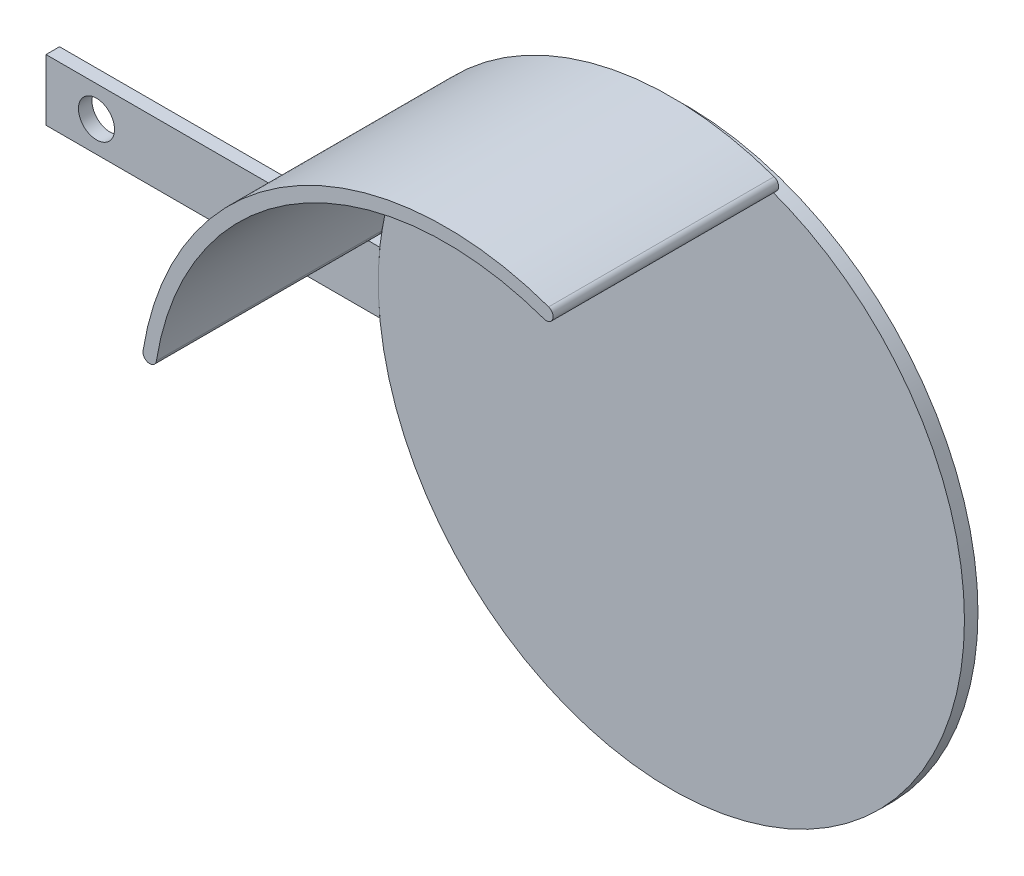
ISO-10303-21;
HEADER;
FILE_DESCRIPTION(('STEP AP214'),'2;1');
FILE_NAME('part.step','',(''),(''),'','','');
FILE_SCHEMA(('AUTOMOTIVE_DESIGN { 1 0 10303 214 1 1 1 1 }'));
ENDSEC;
DATA;
#1=APPLICATION_CONTEXT('core data for automotive mechanical design processes');
#2=APPLICATION_PROTOCOL_DEFINITION('international standard','automotive_design',2000,#1);
#3=PRODUCT_CONTEXT('',#1,'mechanical');
#4=PRODUCT('Part','Part','',(#3));
#5=PRODUCT_RELATED_PRODUCT_CATEGORY('part','',(#4));
#6=PRODUCT_DEFINITION_FORMATION('','',#4);
#7=PRODUCT_DEFINITION_CONTEXT('part definition',#1,'design');
#8=PRODUCT_DEFINITION('design','',#6,#7);
#9=PRODUCT_DEFINITION_SHAPE('','',#8);
#10=(LENGTH_UNIT() NAMED_UNIT(*) SI_UNIT(.MILLI.,.METRE.));
#11=(NAMED_UNIT(*) PLANE_ANGLE_UNIT() SI_UNIT($,.RADIAN.));
#12=(NAMED_UNIT(*) SI_UNIT($,.STERADIAN.) SOLID_ANGLE_UNIT());
#13=UNCERTAINTY_MEASURE_WITH_UNIT(LENGTH_MEASURE(1.E-05),#10,'distance_accuracy_value','');
#14=(GEOMETRIC_REPRESENTATION_CONTEXT(3) GLOBAL_UNCERTAINTY_ASSIGNED_CONTEXT((#13)) GLOBAL_UNIT_ASSIGNED_CONTEXT((#10,
#11,#12)) REPRESENTATION_CONTEXT('',''));
#15=CARTESIAN_POINT('',(0.,0.,0.));
#16=DIRECTION('',(0.,0.,1.));
#17=DIRECTION('',(1.,0.,0.));
#18=AXIS2_PLACEMENT_3D('',#15,#16,#17);
#19=CARTESIAN_POINT('',(22.2866672298137,62.6542453772093,53.));
#20=DIRECTION('',(0.,0.,-1.));
#21=DIRECTION('',(-1.,0.,0.));
#22=AXIS2_PLACEMENT_3D('',#19,#20,#21);
#23=CYLINDRICAL_SURFACE('',#22,1.5);
#24=CARTESIAN_POINT('',(22.2866672298137,62.6542453772093,3.));
#25=DIRECTION('',(0.,0.,1.));
#26=DIRECTION('',(1.,0.,0.));
#27=AXIS2_PLACEMENT_3D('',#24,#25,#26);
#28=CIRCLE('',#27,1.5);
#29=CARTESIAN_POINT('',(21.7839604501938,61.2409917220842,3.));
#30=VERTEX_POINT('',#29);
#31=CARTESIAN_POINT('',(22.7893740094335,64.0674990323343,3.));
#32=VERTEX_POINT('',#31);
#33=EDGE_CURVE('E115',#30,#32,#28,.T.);
#34=ORIENTED_EDGE('',*,*,#33,.T.);
#35=DIRECTION('',(0.,0.,-1.));
#36=VECTOR('',#35,1.);
#37=CARTESIAN_POINT('',(22.7893740094335,64.0674990323343,53.));
#38=LINE('',#37,#36);
#39=CARTESIAN_POINT('',(22.7893740094335,64.0674990323343,53.));
#40=VERTEX_POINT('',#39);
#41=EDGE_CURVE('E12',#40,#32,#38,.T.);
#42=ORIENTED_EDGE('',*,*,#41,.F.);
#43=CARTESIAN_POINT('',(22.2866672298137,62.6542453772093,53.));
#44=DIRECTION('',(0.,0.,1.));
#45=DIRECTION('',(1.,0.,0.));
#46=AXIS2_PLACEMENT_3D('',#43,#44,#45);
#47=CIRCLE('',#46,1.5);
#48=CARTESIAN_POINT('',(21.7839604501938,61.2409917220842,53.));
#49=VERTEX_POINT('',#48);
#50=EDGE_CURVE('E103',#49,#40,#47,.T.);
#51=ORIENTED_EDGE('',*,*,#50,.F.);
#52=DIRECTION('',(0.,0.,-1.));
#53=VECTOR('',#52,1.);
#54=CARTESIAN_POINT('',(21.7839604501938,61.2409917220842,53.));
#55=LINE('',#54,#53);
#56=EDGE_CURVE('E111',#49,#30,#55,.T.);
#57=ORIENTED_EDGE('',*,*,#56,.T.);
#58=EDGE_LOOP('',(#34,#42,#51,#57));
#59=FACE_BOUND('',#58,.T.);
#60=ADVANCED_FACE('F52',(#59),#23,.T.);
#61=CARTESIAN_POINT('',(0.,0.,53.));
#62=DIRECTION('',(0.,0.,-1.));
#63=DIRECTION('',(-1.,0.,0.));
#64=AXIS2_PLACEMENT_3D('',#61,#62,#63);
#65=CYLINDRICAL_SURFACE('',#64,68.);
#66=CARTESIAN_POINT('',(0.,0.,3.));
#67=DIRECTION('',(0.,0.,1.));
#68=DIRECTION('',(1.,0.,0.));
#69=AXIS2_PLACEMENT_3D('',#66,#67,#68);
#70=CIRCLE('',#69,68.);
#71=CARTESIAN_POINT('',(-67.1607273389456,10.6506668009003,3.));
#72=VERTEX_POINT('',#71);
#73=EDGE_CURVE('E107',#32,#72,#70,.T.);
#74=ORIENTED_EDGE('',*,*,#73,.T.);
#75=DIRECTION('',(0.,0.,-1.));
#76=VECTOR('',#75,1.);
#77=CARTESIAN_POINT('',(-67.1607273389456,10.6506668009003,53.));
#78=LINE('',#77,#76);
#79=CARTESIAN_POINT('',(-67.1607273389456,10.6506668009003,53.));
#80=VERTEX_POINT('',#79);
#81=EDGE_CURVE('E60',#80,#72,#78,.T.);
#82=ORIENTED_EDGE('',*,*,#81,.F.);
#83=CARTESIAN_POINT('',(0.,0.,53.));
#84=DIRECTION('',(0.,0.,1.));
#85=DIRECTION('',(1.,0.,0.));
#86=AXIS2_PLACEMENT_3D('',#83,#84,#85);
#87=CIRCLE('',#86,68.);
#88=EDGE_CURVE('E98',#40,#80,#87,.T.);
#89=ORIENTED_EDGE('',*,*,#88,.F.);
#90=ORIENTED_EDGE('',*,*,#41,.T.);
#91=EDGE_LOOP('',(#74,#82,#89,#90));
#92=FACE_BOUND('',#91,.T.);
#93=ADVANCED_FACE('F106',(#92),#65,.T.);
#94=CARTESIAN_POINT('',(-65.6792407064689,10.4157256214686,53.));
#95=DIRECTION('',(0.,0.,-1.));
#96=DIRECTION('',(-1.,0.,0.));
#97=AXIS2_PLACEMENT_3D('',#94,#95,#96);
#98=CYLINDRICAL_SURFACE('',#97,1.49999999999999);
#99=CARTESIAN_POINT('',(-65.6792407064689,10.4157256214686,3.));
#100=DIRECTION('',(0.,0.,1.));
#101=DIRECTION('',(-1.,0.,0.));
#102=AXIS2_PLACEMENT_3D('',#99,#100,#101);
#103=CIRCLE('',#102,1.49999999999999);
#104=CARTESIAN_POINT('',(-64.1977540739922,10.180784442037,3.));
#105=VERTEX_POINT('',#104);
#106=EDGE_CURVE('E85',#72,#105,#103,.T.);
#107=ORIENTED_EDGE('',*,*,#106,.T.);
#108=DIRECTION('',(0.,0.,-1.));
#109=VECTOR('',#108,1.);
#110=CARTESIAN_POINT('',(-64.1977540739922,10.180784442037,53.));
#111=LINE('',#110,#109);
#112=CARTESIAN_POINT('',(-64.1977540739922,10.180784442037,53.));
#113=VERTEX_POINT('',#112);
#114=EDGE_CURVE('E108',#113,#105,#111,.T.);
#115=ORIENTED_EDGE('',*,*,#114,.F.);
#116=CARTESIAN_POINT('',(-65.6792407064689,10.4157256214686,53.));
#117=DIRECTION('',(0.,0.,1.));
#118=DIRECTION('',(-1.,0.,0.));
#119=AXIS2_PLACEMENT_3D('',#116,#117,#118);
#120=CIRCLE('',#119,1.49999999999999);
#121=EDGE_CURVE('E101',#80,#113,#120,.T.);
#122=ORIENTED_EDGE('',*,*,#121,.F.);
#123=ORIENTED_EDGE('',*,*,#81,.T.);
#124=EDGE_LOOP('',(#107,#115,#122,#123));
#125=FACE_BOUND('',#124,.T.);
#126=ADVANCED_FACE('F109',(#125),#98,.T.);
#127=CARTESIAN_POINT('',(0.,0.,53.));
#128=DIRECTION('',(0.,0.,-1.));
#129=DIRECTION('',(-1.,0.,0.));
#130=AXIS2_PLACEMENT_3D('',#127,#128,#129);
#131=CYLINDRICAL_SURFACE('',#130,65.);
#132=CARTESIAN_POINT('',(0.,0.,3.));
#133=DIRECTION('',(0.,0.,-1.));
#134=DIRECTION('',(1.,0.,0.));
#135=AXIS2_PLACEMENT_3D('',#132,#133,#134);
#136=CIRCLE('',#135,65.);
#137=EDGE_CURVE('E91',#105,#30,#136,.T.);
#138=ORIENTED_EDGE('',*,*,#137,.T.);
#139=ORIENTED_EDGE('',*,*,#56,.F.);
#140=CARTESIAN_POINT('',(0.,0.,53.));
#141=DIRECTION('',(0.,0.,-1.));
#142=DIRECTION('',(1.,0.,0.));
#143=AXIS2_PLACEMENT_3D('',#140,#141,#142);
#144=CIRCLE('',#143,65.);
#145=EDGE_CURVE('E68',#113,#49,#144,.T.);
#146=ORIENTED_EDGE('',*,*,#145,.F.);
#147=ORIENTED_EDGE('',*,*,#114,.T.);
#148=EDGE_LOOP('',(#138,#139,#146,#147));
#149=FACE_BOUND('',#148,.T.);
#150=ADVANCED_FACE('F122',(#149),#131,.F.);
#151=CARTESIAN_POINT('',(11.1433336149068,31.3271226886046,53.));
#152=DIRECTION('',(0.,0.,1.));
#153=DIRECTION('',(1.,0.,0.));
#154=AXIS2_PLACEMENT_3D('',#151,#152,#153);
#155=PLANE('',#154);
#156=ORIENTED_EDGE('',*,*,#50,.T.);
#157=ORIENTED_EDGE('',*,*,#88,.T.);
#158=ORIENTED_EDGE('',*,*,#121,.T.);
#159=ORIENTED_EDGE('',*,*,#145,.T.);
#160=EDGE_LOOP('',(#156,#157,#158,#159));
#161=FACE_BOUND('',#160,.T.);
#162=ADVANCED_FACE('F99',(#161),#155,.T.);
#163=CARTESIAN_POINT('',(11.1433336149068,31.3271226886046,3.));
#164=DIRECTION('',(0.,0.,1.));
#165=DIRECTION('',(1.,0.,0.));
#166=AXIS2_PLACEMENT_3D('',#163,#164,#165);
#167=PLANE('',#166);
#168=ORIENTED_EDGE('',*,*,#33,.F.);
#169=ORIENTED_EDGE('',*,*,#137,.F.);
#170=ORIENTED_EDGE('',*,*,#106,.F.);
#171=ORIENTED_EDGE('',*,*,#73,.F.);
#172=EDGE_LOOP('',(#168,#169,#170,#171));
#173=FACE_BOUND('',#172,.T.);
#174=ADVANCED_FACE('F125',(#173),#167,.F.);
#175=CLOSED_SHELL('',(#60,#93,#126,#150,#162,#174));
#176=MANIFOLD_SOLID_BREP('B2',#175);
#177=CARTESIAN_POINT('',(0.,0.,3.));
#178=DIRECTION('',(0.,0.,-1.));
#179=DIRECTION('',(-1.,0.,0.));
#180=AXIS2_PLACEMENT_3D('',#177,#178,#179);
#181=CYLINDRICAL_SURFACE('',#180,65.);
#182=CARTESIAN_POINT('',(0.,0.,0.));
#183=DIRECTION('',(0.,0.,1.));
#184=DIRECTION('',(-1.,0.,0.));
#185=AXIS2_PLACEMENT_3D('',#182,#183,#184);
#186=CIRCLE('',#185,65.);
#187=CARTESIAN_POINT('',(-64.6439231989377,6.79435011239753,0.));
#188=VERTEX_POINT('',#187);
#189=CARTESIAN_POINT('',(-64.6439231989378,-6.79435011239749,0.));
#190=VERTEX_POINT('',#189);
#191=EDGE_CURVE('E247',#188,#190,#186,.T.);
#192=ORIENTED_EDGE('',*,*,#191,.F.);
#193=DIRECTION('',(0.,0.,-1.));
#194=VECTOR('',#193,1.);
#195=CARTESIAN_POINT('',(-64.6439231989377,6.79435011239753,3.));
#196=LINE('',#195,#194);
#197=CARTESIAN_POINT('',(-64.6439231989377,6.79435011239753,3.));
#198=VERTEX_POINT('',#197);
#199=EDGE_CURVE('E50',#198,#188,#196,.T.);
#200=ORIENTED_EDGE('',*,*,#199,.F.);
#201=CARTESIAN_POINT('',(0.,0.,3.));
#202=DIRECTION('',(0.,0.,1.));
#203=DIRECTION('',(-1.,0.,0.));
#204=AXIS2_PLACEMENT_3D('',#201,#202,#203);
#205=CIRCLE('',#204,65.);
#206=CARTESIAN_POINT('',(-64.6439231989378,-6.79435011239749,3.));
#207=VERTEX_POINT('',#206);
#208=EDGE_CURVE('E240',#198,#207,#205,.T.);
#209=ORIENTED_EDGE('',*,*,#208,.T.);
#210=DIRECTION('',(0.,0.,-1.));
#211=VECTOR('',#210,1.);
#212=CARTESIAN_POINT('',(-64.6439231989378,-6.79435011239749,3.));
#213=LINE('',#212,#211);
#214=EDGE_CURVE('E185',#207,#190,#213,.T.);
#215=ORIENTED_EDGE('',*,*,#214,.T.);
#216=EDGE_LOOP('',(#192,#200,#209,#215));
#217=FACE_BOUND('',#216,.T.);
#218=ADVANCED_FACE('F182',(#217),#181,.F.);
#219=CARTESIAN_POINT('',(-64.6439231989377,6.79435011239753,3.));
#220=DIRECTION('',(0.,1.,0.));
#221=DIRECTION('',(0.,0.,1.));
#222=AXIS2_PLACEMENT_3D('',#219,#220,#221);
#223=PLANE('',#222);
#224=DIRECTION('',(1.,0.,0.));
#225=VECTOR('',#224,1.);
#226=CARTESIAN_POINT('',(-64.6439231989377,6.79435011239753,0.));
#227=LINE('',#226,#225);
#228=CARTESIAN_POINT('',(-138.67252235542,6.79435011239753,0.));
#229=VERTEX_POINT('',#228);
#230=EDGE_CURVE('E242',#229,#188,#227,.T.);
#231=ORIENTED_EDGE('',*,*,#230,.F.);
#232=DIRECTION('',(0.,0.,-1.));
#233=VECTOR('',#232,1.);
#234=CARTESIAN_POINT('',(-138.67252235542,6.79435011239753,3.));
#235=LINE('',#234,#233);
#236=CARTESIAN_POINT('',(-138.67252235542,6.79435011239753,3.));
#237=VERTEX_POINT('',#236);
#238=EDGE_CURVE('E191',#237,#229,#235,.T.);
#239=ORIENTED_EDGE('',*,*,#238,.F.);
#240=DIRECTION('',(1.,0.,0.));
#241=VECTOR('',#240,1.);
#242=CARTESIAN_POINT('',(-64.6439231989377,6.79435011239753,3.));
#243=LINE('',#242,#241);
#244=EDGE_CURVE('E237',#237,#198,#243,.T.);
#245=ORIENTED_EDGE('',*,*,#244,.T.);
#246=ORIENTED_EDGE('',*,*,#199,.T.);
#247=EDGE_LOOP('',(#231,#239,#245,#246));
#248=FACE_BOUND('',#247,.T.);
#249=ADVANCED_FACE('F258',(#248),#223,.T.);
#250=CARTESIAN_POINT('',(-138.67252235542,-6.79435011239749,3.));
#251=DIRECTION('',(-1.,0.,0.));
#252=DIRECTION('',(0.,0.,1.));
#253=AXIS2_PLACEMENT_3D('',#250,#251,#252);
#254=PLANE('',#253);
#255=DIRECTION('',(0.,1.,0.));
#256=VECTOR('',#255,1.);
#257=CARTESIAN_POINT('',(-138.67252235542,-6.79435011239749,0.));
#258=LINE('',#257,#256);
#259=CARTESIAN_POINT('',(-138.67252235542,-6.79435011239749,0.));
#260=VERTEX_POINT('',#259);
#261=EDGE_CURVE('E232',#260,#229,#258,.T.);
#262=ORIENTED_EDGE('',*,*,#261,.F.);
#263=DIRECTION('',(0.,0.,-1.));
#264=VECTOR('',#263,1.);
#265=CARTESIAN_POINT('',(-138.67252235542,-6.79435011239749,3.));
#266=LINE('',#265,#264);
#267=CARTESIAN_POINT('',(-138.67252235542,-6.79435011239749,3.));
#268=VERTEX_POINT('',#267);
#269=EDGE_CURVE('E227',#268,#260,#266,.T.);
#270=ORIENTED_EDGE('',*,*,#269,.F.);
#271=DIRECTION('',(0.,1.,0.));
#272=VECTOR('',#271,1.);
#273=CARTESIAN_POINT('',(-138.67252235542,-6.79435011239749,3.));
#274=LINE('',#273,#272);
#275=EDGE_CURVE('E230',#268,#237,#274,.T.);
#276=ORIENTED_EDGE('',*,*,#275,.T.);
#277=ORIENTED_EDGE('',*,*,#238,.T.);
#278=EDGE_LOOP('',(#262,#270,#276,#277));
#279=FACE_BOUND('',#278,.T.);
#280=ADVANCED_FACE('F229',(#279),#254,.T.);
#281=CARTESIAN_POINT('',(-64.6439231989378,-6.79435011239749,3.));
#282=DIRECTION('',(0.,-1.,0.));
#283=DIRECTION('',(0.,0.,-1.));
#284=AXIS2_PLACEMENT_3D('',#281,#282,#283);
#285=PLANE('',#284);
#286=DIRECTION('',(-1.,0.,0.));
#287=VECTOR('',#286,1.);
#288=CARTESIAN_POINT('',(-64.6439231989378,-6.79435011239749,0.));
#289=LINE('',#288,#287);
#290=EDGE_CURVE('E250',#190,#260,#289,.T.);
#291=ORIENTED_EDGE('',*,*,#290,.F.);
#292=ORIENTED_EDGE('',*,*,#214,.F.);
#293=DIRECTION('',(-1.,0.,0.));
#294=VECTOR('',#293,1.);
#295=CARTESIAN_POINT('',(-64.6439231989378,-6.79435011239749,3.));
#296=LINE('',#295,#294);
#297=EDGE_CURVE('E236',#207,#268,#296,.T.);
#298=ORIENTED_EDGE('',*,*,#297,.T.);
#299=ORIENTED_EDGE('',*,*,#269,.T.);
#300=EDGE_LOOP('',(#291,#292,#298,#299));
#301=FACE_BOUND('',#300,.T.);
#302=ADVANCED_FACE('F239',(#301),#285,.T.);
#303=CARTESIAN_POINT('',(0.,0.,3.));
#304=DIRECTION('',(0.,0.,-1.));
#305=DIRECTION('',(-1.,0.,0.));
#306=AXIS2_PLACEMENT_3D('',#303,#304,#305);
#307=PLANE('',#306);
#308=CARTESIAN_POINT('',(-127.477067306325,0.,3.));
#309=DIRECTION('',(0.,0.,1.));
#310=DIRECTION('',(1.,0.,0.));
#311=AXIS2_PLACEMENT_3D('',#308,#309,#310);
#312=CIRCLE('',#311,4.00000000000001);
#313=CARTESIAN_POINT('',(-123.477067306325,0.,3.));
#314=VERTEX_POINT('',#313);
#315=EDGE_CURVE('E288',#314,#314,#312,.T.);
#316=ORIENTED_EDGE('',*,*,#315,.F.);
#317=EDGE_LOOP('',(#316));
#318=FACE_BOUND('',#317,.T.);
#319=ORIENTED_EDGE('',*,*,#208,.F.);
#320=ORIENTED_EDGE('',*,*,#244,.F.);
#321=ORIENTED_EDGE('',*,*,#275,.F.);
#322=ORIENTED_EDGE('',*,*,#297,.F.);
#323=EDGE_LOOP('',(#319,#320,#321,#322));
#324=FACE_BOUND('',#323,.T.);
#325=ADVANCED_FACE('F235',(#318,#324),#307,.F.);
#326=CARTESIAN_POINT('',(0.,0.,0.));
#327=DIRECTION('',(0.,0.,-1.));
#328=DIRECTION('',(-1.,0.,0.));
#329=AXIS2_PLACEMENT_3D('',#326,#327,#328);
#330=PLANE('',#329);
#331=CARTESIAN_POINT('',(-127.477067306325,0.,0.));
#332=DIRECTION('',(0.,0.,1.));
#333=DIRECTION('',(1.,0.,0.));
#334=AXIS2_PLACEMENT_3D('',#331,#332,#333);
#335=CIRCLE('',#334,4.00000000000001);
#336=CARTESIAN_POINT('',(-123.477067306325,0.,0.));
#337=VERTEX_POINT('',#336);
#338=EDGE_CURVE('E251',#337,#337,#335,.T.);
#339=ORIENTED_EDGE('',*,*,#338,.T.);
#340=EDGE_LOOP('',(#339));
#341=FACE_BOUND('',#340,.T.);
#342=ORIENTED_EDGE('',*,*,#191,.T.);
#343=ORIENTED_EDGE('',*,*,#290,.T.);
#344=ORIENTED_EDGE('',*,*,#261,.T.);
#345=ORIENTED_EDGE('',*,*,#230,.T.);
#346=EDGE_LOOP('',(#342,#343,#344,#345));
#347=FACE_BOUND('',#346,.T.);
#348=ADVANCED_FACE('F257',(#341,#347),#330,.T.);
#349=CARTESIAN_POINT('',(-127.477067306325,0.,0.));
#350=DIRECTION('',(0.,0.,1.));
#351=DIRECTION('',(1.,0.,0.));
#352=AXIS2_PLACEMENT_3D('',#349,#350,#351);
#353=CYLINDRICAL_SURFACE('',#352,4.00000000000001);
#354=ORIENTED_EDGE('',*,*,#338,.F.);
#355=EDGE_LOOP('',(#354));
#356=FACE_BOUND('',#355,.T.);
#357=ORIENTED_EDGE('',*,*,#315,.T.);
#358=EDGE_LOOP('',(#357));
#359=FACE_BOUND('',#358,.T.);
#360=ADVANCED_FACE('F276',(#356,#359),#353,.F.);
#361=CLOSED_SHELL('',(#218,#249,#280,#302,#325,#348,#360));
#362=MANIFOLD_SOLID_BREP('B6',#361);
#363=CARTESIAN_POINT('',(0.,0.,3.));
#364=DIRECTION('',(0.,0.,-1.));
#365=DIRECTION('',(-1.,0.,0.));
#366=AXIS2_PLACEMENT_3D('',#363,#364,#365);
#367=CYLINDRICAL_SURFACE('',#366,65.);
#368=CARTESIAN_POINT('',(0.,0.,3.));
#369=DIRECTION('',(0.,0.,1.));
#370=DIRECTION('',(1.,0.,0.));
#371=AXIS2_PLACEMENT_3D('',#368,#369,#370);
#372=CIRCLE('',#371,65.);
#373=CARTESIAN_POINT('',(65.,0.,3.));
#374=VERTEX_POINT('',#373);
#375=EDGE_CURVE('E181',#374,#374,#372,.T.);
#376=ORIENTED_EDGE('',*,*,#375,.F.);
#377=EDGE_LOOP('',(#376));
#378=FACE_BOUND('',#377,.T.);
#379=CARTESIAN_POINT('',(0.,0.,0.));
#380=DIRECTION('',(0.,0.,1.));
#381=DIRECTION('',(1.,0.,0.));
#382=AXIS2_PLACEMENT_3D('',#379,#380,#381);
#383=CIRCLE('',#382,65.);
#384=CARTESIAN_POINT('',(65.,0.,0.));
#385=VERTEX_POINT('',#384);
#386=EDGE_CURVE('E329',#385,#385,#383,.T.);
#387=ORIENTED_EDGE('',*,*,#386,.T.);
#388=EDGE_LOOP('',(#387));
#389=FACE_BOUND('',#388,.T.);
#390=ADVANCED_FACE('F326',(#378,#389),#367,.T.);
#391=CARTESIAN_POINT('',(0.,0.,3.));
#392=DIRECTION('',(0.,0.,1.));
#393=DIRECTION('',(1.,0.,0.));
#394=AXIS2_PLACEMENT_3D('',#391,#392,#393);
#395=PLANE('',#394);
#396=ORIENTED_EDGE('',*,*,#375,.T.);
#397=EDGE_LOOP('',(#396));
#398=FACE_BOUND('',#397,.T.);
#399=ADVANCED_FACE('F341',(#398),#395,.T.);
#400=CARTESIAN_POINT('',(0.,0.,0.));
#401=DIRECTION('',(0.,0.,1.));
#402=DIRECTION('',(1.,0.,0.));
#403=AXIS2_PLACEMENT_3D('',#400,#401,#402);
#404=PLANE('',#403);
#405=ORIENTED_EDGE('',*,*,#386,.F.);
#406=EDGE_LOOP('',(#405));
#407=FACE_BOUND('',#406,.T.);
#408=ADVANCED_FACE('F339',(#407),#404,.F.);
#409=CLOSED_SHELL('',(#390,#399,#408));
#410=MANIFOLD_SOLID_BREP('B44',#409);
#411=ADVANCED_BREP_SHAPE_REPRESENTATION('',(#18,#176,#362,#410),#14);
#412=SHAPE_DEFINITION_REPRESENTATION(#9,#411);
ENDSEC;
END-ISO-10303-21;
